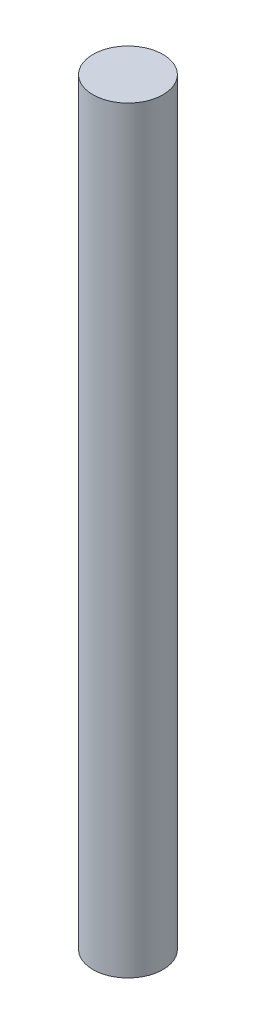
ISO-10303-21;
HEADER;
FILE_DESCRIPTION(('STEP AP214'),'2;1');
FILE_NAME('part.step','',(''),(''),'','','');
FILE_SCHEMA(('AUTOMOTIVE_DESIGN { 1 0 10303 214 1 1 1 1 }'));
ENDSEC;
DATA;
#1=APPLICATION_CONTEXT('core data for automotive mechanical design processes');
#2=APPLICATION_PROTOCOL_DEFINITION('international standard','automotive_design',2000,#1);
#3=PRODUCT_CONTEXT('',#1,'mechanical');
#4=PRODUCT('Part','Part','',(#3));
#5=PRODUCT_RELATED_PRODUCT_CATEGORY('part','',(#4));
#6=PRODUCT_DEFINITION_FORMATION('','',#4);
#7=PRODUCT_DEFINITION_CONTEXT('part definition',#1,'design');
#8=PRODUCT_DEFINITION('design','',#6,#7);
#9=PRODUCT_DEFINITION_SHAPE('','',#8);
#10=(LENGTH_UNIT() NAMED_UNIT(*) SI_UNIT(.MILLI.,.METRE.));
#11=(NAMED_UNIT(*) PLANE_ANGLE_UNIT() SI_UNIT($,.RADIAN.));
#12=(NAMED_UNIT(*) SI_UNIT($,.STERADIAN.) SOLID_ANGLE_UNIT());
#13=UNCERTAINTY_MEASURE_WITH_UNIT(LENGTH_MEASURE(1.E-05),#10,'distance_accuracy_value','');
#14=(GEOMETRIC_REPRESENTATION_CONTEXT(3) GLOBAL_UNCERTAINTY_ASSIGNED_CONTEXT((#13)) GLOBAL_UNIT_ASSIGNED_CONTEXT((#10,
#11,#12)) REPRESENTATION_CONTEXT('',''));
#15=CARTESIAN_POINT('',(0.,0.,0.));
#16=DIRECTION('',(0.,0.,1.));
#17=DIRECTION('',(1.,0.,0.));
#18=AXIS2_PLACEMENT_3D('',#15,#16,#17);
#19=CARTESIAN_POINT('',(0.,65.,0.));
#20=DIRECTION('',(0.,-1.,0.));
#21=DIRECTION('',(0.,0.,-1.));
#22=AXIS2_PLACEMENT_3D('',#19,#20,#21);
#23=CYLINDRICAL_SURFACE('',#22,3.);
#24=CARTESIAN_POINT('',(0.,65.,0.));
#25=DIRECTION('',(0.,1.,0.));
#26=DIRECTION('',(0.,0.,1.));
#27=AXIS2_PLACEMENT_3D('',#24,#25,#26);
#28=CIRCLE('',#27,3.);
#29=CARTESIAN_POINT('',(0.,65.,3.));
#30=VERTEX_POINT('',#29);
#31=EDGE_CURVE('E10',#30,#30,#28,.T.);
#32=ORIENTED_EDGE('',*,*,#31,.F.);
#33=EDGE_LOOP('',(#32));
#34=FACE_BOUND('',#33,.T.);
#35=CARTESIAN_POINT('',(0.,0.,0.));
#36=DIRECTION('',(0.,1.,0.));
#37=DIRECTION('',(0.,0.,1.));
#38=AXIS2_PLACEMENT_3D('',#35,#36,#37);
#39=CIRCLE('',#38,3.);
#40=CARTESIAN_POINT('',(0.,0.,3.));
#41=VERTEX_POINT('',#40);
#42=EDGE_CURVE('E46',#41,#41,#39,.T.);
#43=ORIENTED_EDGE('',*,*,#42,.T.);
#44=EDGE_LOOP('',(#43));
#45=FACE_BOUND('',#44,.T.);
#46=ADVANCED_FACE('F43',(#34,#45),#23,.T.);
#47=CARTESIAN_POINT('',(0.,65.,0.));
#48=DIRECTION('',(0.,1.,0.));
#49=DIRECTION('',(0.,0.,1.));
#50=AXIS2_PLACEMENT_3D('',#47,#48,#49);
#51=PLANE('',#50);
#52=ORIENTED_EDGE('',*,*,#31,.T.);
#53=EDGE_LOOP('',(#52));
#54=FACE_BOUND('',#53,.T.);
#55=ADVANCED_FACE('F58',(#54),#51,.T.);
#56=CARTESIAN_POINT('',(0.,0.,0.));
#57=DIRECTION('',(0.,1.,0.));
#58=DIRECTION('',(0.,0.,1.));
#59=AXIS2_PLACEMENT_3D('',#56,#57,#58);
#60=PLANE('',#59);
#61=ORIENTED_EDGE('',*,*,#42,.F.);
#62=EDGE_LOOP('',(#61));
#63=FACE_BOUND('',#62,.T.);
#64=ADVANCED_FACE('F56',(#63),#60,.F.);
#65=CLOSED_SHELL('',(#46,#55,#64));
#66=MANIFOLD_SOLID_BREP('B2',#65);
#67=ADVANCED_BREP_SHAPE_REPRESENTATION('',(#18,#66),#14);
#68=SHAPE_DEFINITION_REPRESENTATION(#9,#67);
ENDSEC;
END-ISO-10303-21;
